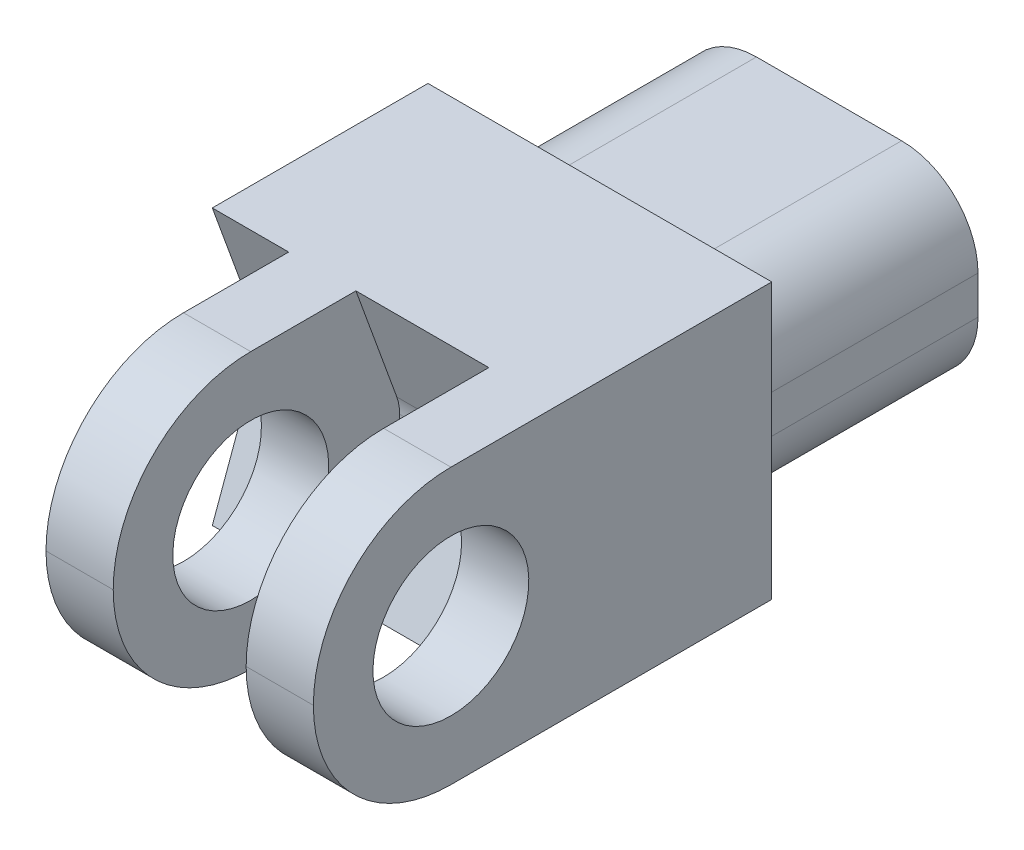
ISO-10303-21;
HEADER;
FILE_DESCRIPTION(('STEP AP214'),'2;1');
FILE_NAME('part.step','',(''),(''),'','','');
FILE_SCHEMA(('AUTOMOTIVE_DESIGN { 1 0 10303 214 1 1 1 1 }'));
ENDSEC;
DATA;
#1=APPLICATION_CONTEXT('core data for automotive mechanical design processes');
#2=APPLICATION_PROTOCOL_DEFINITION('international standard','automotive_design',2000,#1);
#3=PRODUCT_CONTEXT('',#1,'mechanical');
#4=PRODUCT('Part','Part','',(#3));
#5=PRODUCT_RELATED_PRODUCT_CATEGORY('part','',(#4));
#6=PRODUCT_DEFINITION_FORMATION('','',#4);
#7=PRODUCT_DEFINITION_CONTEXT('part definition',#1,'design');
#8=PRODUCT_DEFINITION('design','',#6,#7);
#9=PRODUCT_DEFINITION_SHAPE('','',#8);
#10=(LENGTH_UNIT() NAMED_UNIT(*) SI_UNIT(.MILLI.,.METRE.));
#11=(NAMED_UNIT(*) PLANE_ANGLE_UNIT() SI_UNIT($,.RADIAN.));
#12=(NAMED_UNIT(*) SI_UNIT($,.STERADIAN.) SOLID_ANGLE_UNIT());
#13=UNCERTAINTY_MEASURE_WITH_UNIT(LENGTH_MEASURE(1.E-05),#10,'distance_accuracy_value','');
#14=(GEOMETRIC_REPRESENTATION_CONTEXT(3) GLOBAL_UNCERTAINTY_ASSIGNED_CONTEXT((#13)) GLOBAL_UNIT_ASSIGNED_CONTEXT((#10,
#11,#12)) REPRESENTATION_CONTEXT('',''));
#15=CARTESIAN_POINT('',(0.,0.,0.));
#16=DIRECTION('',(0.,0.,1.));
#17=DIRECTION('',(1.,0.,0.));
#18=AXIS2_PLACEMENT_3D('',#15,#16,#17);
#19=CARTESIAN_POINT('',(-2.3495,11.43,38.1));
#20=DIRECTION('',(-1.,0.,0.));
#21=DIRECTION('',(0.,-1.,0.));
#22=AXIS2_PLACEMENT_3D('',#19,#20,#21);
#23=PLANE('',#22);
#24=CARTESIAN_POINT('',(-2.3495,0.,26.67));
#25=DIRECTION('',(-1.,0.,0.));
#26=DIRECTION('',(0.,-1.,0.));
#27=AXIS2_PLACEMENT_3D('',#24,#25,#26);
#28=CIRCLE('',#27,6.477);
#29=CARTESIAN_POINT('',(-2.3495,-6.477,26.67));
#30=VERTEX_POINT('',#29);
#31=EDGE_CURVE('E299',#30,#30,#28,.T.);
#32=ORIENTED_EDGE('',*,*,#31,.T.);
#33=EDGE_LOOP('',(#32));
#34=FACE_BOUND('',#33,.T.);
#35=DIRECTION('',(0.,-0.93969262078591,0.342020143325663));
#36=VECTOR('',#35,1.);
#37=CARTESIAN_POINT('',(-2.3495,2.27247579142483,12.9399090188302));
#38=LINE('',#37,#36);
#39=CARTESIAN_POINT('',(-2.3495,-2.09277265046882,14.5287295168564));
#40=VERTEX_POINT('',#39);
#41=CARTESIAN_POINT('',(-2.3495,-11.43,17.9272023426619));
#42=VERTEX_POINT('',#41);
#43=EDGE_CURVE('E266',#40,#42,#38,.T.);
#44=ORIENTED_EDGE('',*,*,#43,.F.);
#45=CARTESIAN_POINT('',(-2.3495,-0.724692077166165,18.2875));
#46=DIRECTION('',(-1.,0.,0.));
#47=DIRECTION('',(0.,-1.,0.));
#48=AXIS2_PLACEMENT_3D('',#45,#46,#47);
#49=CIRCLE('',#48,4.);
#50=CARTESIAN_POINT('',(-2.3495,-0.724692077166165,14.2875));
#51=VERTEX_POINT('',#50);
#52=EDGE_CURVE('E497',#40,#51,#49,.F.);
#53=ORIENTED_EDGE('',*,*,#52,.T.);
#54=DIRECTION('',(0.,-1.,0.));
#55=VECTOR('',#54,1.);
#56=CARTESIAN_POINT('',(-2.34950000000001,11.43,14.2875));
#57=LINE('',#56,#55);
#58=CARTESIAN_POINT('',(-2.3495,0.724692077166165,14.2875));
#59=VERTEX_POINT('',#58);
#60=EDGE_CURVE('E326',#59,#51,#57,.T.);
#61=ORIENTED_EDGE('',*,*,#60,.F.);
#62=CARTESIAN_POINT('',(-2.3495,0.724692077166165,18.2875));
#63=DIRECTION('',(-1.,0.,0.));
#64=DIRECTION('',(0.,-1.,0.));
#65=AXIS2_PLACEMENT_3D('',#62,#63,#64);
#66=CIRCLE('',#65,4.);
#67=CARTESIAN_POINT('',(-2.3495,2.09277265046882,14.5287295168564));
#68=VERTEX_POINT('',#67);
#69=EDGE_CURVE('E494',#59,#68,#66,.F.);
#70=ORIENTED_EDGE('',*,*,#69,.T.);
#71=DIRECTION('',(0.,0.93969262078591,0.342020143325663));
#72=VECTOR('',#71,1.);
#73=CARTESIAN_POINT('',(-2.34950000000001,17.9134121934252,20.2869713975472));
#74=LINE('',#73,#72);
#75=CARTESIAN_POINT('',(-2.3495,11.43,17.927202342662));
#76=VERTEX_POINT('',#75);
#77=EDGE_CURVE('E284',#68,#76,#74,.T.);
#78=ORIENTED_EDGE('',*,*,#77,.T.);
#79=DIRECTION('',(0.,0.,-1.));
#80=VECTOR('',#79,1.);
#81=CARTESIAN_POINT('',(-2.3495,11.43,38.1));
#82=LINE('',#81,#80);
#83=CARTESIAN_POINT('',(-2.3495,11.43,26.67));
#84=VERTEX_POINT('',#83);
#85=EDGE_CURVE('E318',#84,#76,#82,.T.);
#86=ORIENTED_EDGE('',*,*,#85,.F.);
#87=CARTESIAN_POINT('',(-2.3495,0.,26.67));
#88=DIRECTION('',(-1.,0.,0.));
#89=DIRECTION('',(0.,-1.,0.));
#90=AXIS2_PLACEMENT_3D('',#87,#88,#89);
#91=CIRCLE('',#90,11.43);
#92=CARTESIAN_POINT('',(-2.3495,0.,38.1));
#93=VERTEX_POINT('',#92);
#94=EDGE_CURVE('E378',#84,#93,#91,.F.);
#95=ORIENTED_EDGE('',*,*,#94,.T.);
#96=CARTESIAN_POINT('',(-2.3495,0.,26.67));
#97=DIRECTION('',(-1.,0.,0.));
#98=DIRECTION('',(0.,-1.,0.));
#99=AXIS2_PLACEMENT_3D('',#96,#97,#98);
#100=CIRCLE('',#99,11.43);
#101=CARTESIAN_POINT('',(-2.3495,-11.43,26.67));
#102=VERTEX_POINT('',#101);
#103=EDGE_CURVE('E395',#93,#102,#100,.F.);
#104=ORIENTED_EDGE('',*,*,#103,.T.);
#105=DIRECTION('',(0.,0.,-1.));
#106=VECTOR('',#105,1.);
#107=CARTESIAN_POINT('',(-2.3495,-11.43,38.1));
#108=LINE('',#107,#106);
#109=EDGE_CURVE('E327',#102,#42,#108,.T.);
#110=ORIENTED_EDGE('',*,*,#109,.T.);
#111=EDGE_LOOP('',(#44,#53,#61,#70,#78,#86,#95,#104,#110));
#112=FACE_BOUND('',#111,.T.);
#113=ADVANCED_FACE('F41',(#34,#112),#23,.F.);
#114=CARTESIAN_POINT('',(8.6995,11.43,38.1));
#115=DIRECTION('',(1.,0.,0.));
#116=DIRECTION('',(0.,1.,0.));
#117=AXIS2_PLACEMENT_3D('',#114,#115,#116);
#118=PLANE('',#117);
#119=CARTESIAN_POINT('',(8.6995,0.,26.67));
#120=DIRECTION('',(1.,0.,0.));
#121=DIRECTION('',(0.,1.,0.));
#122=AXIS2_PLACEMENT_3D('',#119,#120,#121);
#123=CIRCLE('',#122,6.477);
#124=CARTESIAN_POINT('',(8.6995,6.477,26.67));
#125=VERTEX_POINT('',#124);
#126=EDGE_CURVE('E292',#125,#125,#123,.T.);
#127=ORIENTED_EDGE('',*,*,#126,.T.);
#128=EDGE_LOOP('',(#127));
#129=FACE_BOUND('',#128,.T.);
#130=DIRECTION('',(0.,-1.,0.));
#131=VECTOR('',#130,1.);
#132=CARTESIAN_POINT('',(8.6995,11.43,14.2875));
#133=LINE('',#132,#131);
#134=CARTESIAN_POINT('',(8.6995,0.72469207716617,14.2875));
#135=VERTEX_POINT('',#134);
#136=CARTESIAN_POINT('',(8.6995,-0.72469207716617,14.2875));
#137=VERTEX_POINT('',#136);
#138=EDGE_CURVE('E310',#135,#137,#133,.T.);
#139=ORIENTED_EDGE('',*,*,#138,.T.);
#140=CARTESIAN_POINT('',(8.6995,-0.72469207716617,18.2875));
#141=DIRECTION('',(1.,0.,0.));
#142=DIRECTION('',(0.,1.,0.));
#143=AXIS2_PLACEMENT_3D('',#140,#141,#142);
#144=CIRCLE('',#143,4.);
#145=CARTESIAN_POINT('',(8.6995,-2.09277265046882,14.5287295168564));
#146=VERTEX_POINT('',#145);
#147=EDGE_CURVE('E510',#137,#146,#144,.F.);
#148=ORIENTED_EDGE('',*,*,#147,.T.);
#149=DIRECTION('',(0.,0.93969262078591,-0.342020143325663));
#150=VECTOR('',#149,1.);
#151=CARTESIAN_POINT('',(8.6995,2.27247579142483,12.9399090188302));
#152=LINE('',#151,#150);
#153=CARTESIAN_POINT('',(8.6995,-11.43,17.9272023426619));
#154=VERTEX_POINT('',#153);
#155=EDGE_CURVE('E262',#154,#146,#152,.T.);
#156=ORIENTED_EDGE('',*,*,#155,.F.);
#157=DIRECTION('',(0.,0.,1.));
#158=VECTOR('',#157,1.);
#159=CARTESIAN_POINT('',(8.6995,-11.43,38.1));
#160=LINE('',#159,#158);
#161=CARTESIAN_POINT('',(8.6995,-11.43,26.67));
#162=VERTEX_POINT('',#161);
#163=EDGE_CURVE('E323',#154,#162,#160,.T.);
#164=ORIENTED_EDGE('',*,*,#163,.T.);
#165=CARTESIAN_POINT('',(8.6995,0.,26.67));
#166=DIRECTION('',(1.,0.,0.));
#167=DIRECTION('',(0.,1.,0.));
#168=AXIS2_PLACEMENT_3D('',#165,#166,#167);
#169=CIRCLE('',#168,11.43);
#170=CARTESIAN_POINT('',(8.6995,0.,38.1));
#171=VERTEX_POINT('',#170);
#172=EDGE_CURVE('E419',#162,#171,#169,.F.);
#173=ORIENTED_EDGE('',*,*,#172,.T.);
#174=CARTESIAN_POINT('',(8.6995,0.,26.67));
#175=DIRECTION('',(1.,0.,0.));
#176=DIRECTION('',(0.,1.,0.));
#177=AXIS2_PLACEMENT_3D('',#174,#175,#176);
#178=CIRCLE('',#177,11.43);
#179=CARTESIAN_POINT('',(8.6995,11.43,26.67));
#180=VERTEX_POINT('',#179);
#181=EDGE_CURVE('E422',#171,#180,#178,.F.);
#182=ORIENTED_EDGE('',*,*,#181,.T.);
#183=DIRECTION('',(0.,0.,1.));
#184=VECTOR('',#183,1.);
#185=CARTESIAN_POINT('',(8.6995,11.43,38.1));
#186=LINE('',#185,#184);
#187=CARTESIAN_POINT('',(8.6995,11.43,17.927202342662));
#188=VERTEX_POINT('',#187);
#189=EDGE_CURVE('E322',#188,#180,#186,.T.);
#190=ORIENTED_EDGE('',*,*,#189,.F.);
#191=DIRECTION('',(0.,-0.93969262078591,-0.342020143325663));
#192=VECTOR('',#191,1.);
#193=CARTESIAN_POINT('',(8.6995,17.9134121934252,20.2869713975472));
#194=LINE('',#193,#192);
#195=CARTESIAN_POINT('',(8.6995,2.09277265046882,14.5287295168564));
#196=VERTEX_POINT('',#195);
#197=EDGE_CURVE('E280',#188,#196,#194,.T.);
#198=ORIENTED_EDGE('',*,*,#197,.T.);
#199=CARTESIAN_POINT('',(8.6995,0.72469207716617,18.2875));
#200=DIRECTION('',(1.,0.,0.));
#201=DIRECTION('',(0.,1.,0.));
#202=AXIS2_PLACEMENT_3D('',#199,#200,#201);
#203=CIRCLE('',#202,4.);
#204=EDGE_CURVE('E507',#196,#135,#203,.F.);
#205=ORIENTED_EDGE('',*,*,#204,.T.);
#206=EDGE_LOOP('',(#139,#148,#156,#164,#173,#182,#190,#198,#205));
#207=FACE_BOUND('',#206,.T.);
#208=ADVANCED_FACE('F551',(#129,#207),#118,.F.);
#209=CARTESIAN_POINT('',(-2.34950000000001,11.43,14.2875));
#210=DIRECTION('',(0.,0.,-1.));
#211=DIRECTION('',(-1.,0.,0.));
#212=AXIS2_PLACEMENT_3D('',#209,#210,#211);
#213=PLANE('',#212);
#214=ORIENTED_EDGE('',*,*,#60,.T.);
#215=DIRECTION('',(-1.,0.,0.));
#216=VECTOR('',#215,1.);
#217=CARTESIAN_POINT('',(8.69950000000001,-0.72469207716617,14.2875));
#218=LINE('',#217,#216);
#219=EDGE_CURVE('E504',#51,#137,#218,.F.);
#220=ORIENTED_EDGE('',*,*,#219,.T.);
#221=ORIENTED_EDGE('',*,*,#138,.F.);
#222=DIRECTION('',(-1.,0.,0.));
#223=VECTOR('',#222,1.);
#224=CARTESIAN_POINT('',(-2.3495,0.724692077166165,14.2875));
#225=LINE('',#224,#223);
#226=EDGE_CURVE('E500',#135,#59,#225,.T.);
#227=ORIENTED_EDGE('',*,*,#226,.T.);
#228=EDGE_LOOP('',(#214,#220,#221,#227));
#229=FACE_BOUND('',#228,.T.);
#230=ADVANCED_FACE('F558',(#229),#213,.F.);
#231=CARTESIAN_POINT('',(-7.9375,11.43,38.1));
#232=DIRECTION('',(1.,0.,0.));
#233=DIRECTION('',(0.,1.,0.));
#234=AXIS2_PLACEMENT_3D('',#231,#232,#233);
#235=PLANE('',#234);
#236=CARTESIAN_POINT('',(-7.9375,0.,26.67));
#237=DIRECTION('',(-1.,0.,0.));
#238=DIRECTION('',(0.,-1.,0.));
#239=AXIS2_PLACEMENT_3D('',#236,#237,#238);
#240=CIRCLE('',#239,6.477);
#241=CARTESIAN_POINT('',(-7.9375,-6.477,26.67));
#242=VERTEX_POINT('',#241);
#243=EDGE_CURVE('E287',#242,#242,#240,.T.);
#244=ORIENTED_EDGE('',*,*,#243,.F.);
#245=EDGE_LOOP('',(#244));
#246=FACE_BOUND('',#245,.T.);
#247=DIRECTION('',(0.,-1.,0.));
#248=VECTOR('',#247,1.);
#249=CARTESIAN_POINT('',(-7.9375,11.43,14.2875));
#250=LINE('',#249,#248);
#251=CARTESIAN_POINT('',(-7.9375,0.724692077166156,14.2875));
#252=VERTEX_POINT('',#251);
#253=CARTESIAN_POINT('',(-7.9375,-0.724692077166153,14.2875));
#254=VERTEX_POINT('',#253);
#255=EDGE_CURVE('E311',#252,#254,#250,.T.);
#256=ORIENTED_EDGE('',*,*,#255,.T.);
#257=CARTESIAN_POINT('',(-7.9375,-0.724692077166153,18.2875));
#258=DIRECTION('',(1.,0.,0.));
#259=DIRECTION('',(0.,1.,0.));
#260=AXIS2_PLACEMENT_3D('',#257,#258,#259);
#261=CIRCLE('',#260,4.);
#262=CARTESIAN_POINT('',(-7.9375,-2.09277265046881,14.5287295168564));
#263=VERTEX_POINT('',#262);
#264=EDGE_CURVE('E528',#254,#263,#261,.F.);
#265=ORIENTED_EDGE('',*,*,#264,.T.);
#266=DIRECTION('',(0.,0.93969262078591,-0.342020143325663));
#267=VECTOR('',#266,1.);
#268=CARTESIAN_POINT('',(-7.9375,2.27247579142483,12.9399090188302));
#269=LINE('',#268,#267);
#270=CARTESIAN_POINT('',(-7.9375,-11.43,17.9272023426619));
#271=VERTEX_POINT('',#270);
#272=EDGE_CURVE('E258',#271,#263,#269,.T.);
#273=ORIENTED_EDGE('',*,*,#272,.F.);
#274=DIRECTION('',(0.,0.,1.));
#275=VECTOR('',#274,1.);
#276=CARTESIAN_POINT('',(-7.9375,-11.43,38.1));
#277=LINE('',#276,#275);
#278=CARTESIAN_POINT('',(-7.9375,-11.43,26.67));
#279=VERTEX_POINT('',#278);
#280=EDGE_CURVE('E252',#271,#279,#277,.T.);
#281=ORIENTED_EDGE('',*,*,#280,.T.);
#282=CARTESIAN_POINT('',(-7.9375,0.,26.67));
#283=DIRECTION('',(1.,0.,0.));
#284=DIRECTION('',(0.,1.,0.));
#285=AXIS2_PLACEMENT_3D('',#282,#283,#284);
#286=CIRCLE('',#285,11.43);
#287=CARTESIAN_POINT('',(-7.9375,0.,38.1));
#288=VERTEX_POINT('',#287);
#289=EDGE_CURVE('E409',#279,#288,#286,.F.);
#290=ORIENTED_EDGE('',*,*,#289,.T.);
#291=CARTESIAN_POINT('',(-7.9375,0.,26.67));
#292=DIRECTION('',(1.,0.,0.));
#293=DIRECTION('',(0.,1.,0.));
#294=AXIS2_PLACEMENT_3D('',#291,#292,#293);
#295=CIRCLE('',#294,11.43);
#296=CARTESIAN_POINT('',(-7.9375,11.43,26.67));
#297=VERTEX_POINT('',#296);
#298=EDGE_CURVE('E405',#288,#297,#295,.F.);
#299=ORIENTED_EDGE('',*,*,#298,.T.);
#300=DIRECTION('',(0.,0.,1.));
#301=VECTOR('',#300,1.);
#302=CARTESIAN_POINT('',(-7.9375,11.43,38.1));
#303=LINE('',#302,#301);
#304=CARTESIAN_POINT('',(-7.9375,11.43,17.927202342662));
#305=VERTEX_POINT('',#304);
#306=EDGE_CURVE('E304',#305,#297,#303,.T.);
#307=ORIENTED_EDGE('',*,*,#306,.F.);
#308=DIRECTION('',(0.,-0.93969262078591,-0.342020143325663));
#309=VECTOR('',#308,1.);
#310=CARTESIAN_POINT('',(-7.93750000000001,17.9134121934252,20.2869713975472));
#311=LINE('',#310,#309);
#312=CARTESIAN_POINT('',(-7.9375,2.09277265046881,14.5287295168564));
#313=VERTEX_POINT('',#312);
#314=EDGE_CURVE('E277',#305,#313,#311,.T.);
#315=ORIENTED_EDGE('',*,*,#314,.T.);
#316=CARTESIAN_POINT('',(-7.9375,0.724692077166155,18.2875));
#317=DIRECTION('',(1.,0.,0.));
#318=DIRECTION('',(0.,1.,0.));
#319=AXIS2_PLACEMENT_3D('',#316,#317,#318);
#320=CIRCLE('',#319,4.);
#321=EDGE_CURVE('E525',#313,#252,#320,.F.);
#322=ORIENTED_EDGE('',*,*,#321,.T.);
#323=EDGE_LOOP('',(#256,#265,#273,#281,#290,#299,#307,#315,#322));
#324=FACE_BOUND('',#323,.T.);
#325=ADVANCED_FACE('F542',(#246,#324),#235,.F.);
#326=CARTESIAN_POINT('',(-14.2875,11.43,14.2875));
#327=DIRECTION('',(0.,0.,-1.));
#328=DIRECTION('',(-1.,0.,0.));
#329=AXIS2_PLACEMENT_3D('',#326,#327,#328);
#330=PLANE('',#329);
#331=DIRECTION('',(0.,-1.,0.));
#332=VECTOR('',#331,1.);
#333=CARTESIAN_POINT('',(-14.2875,11.43,14.2875));
#334=LINE('',#333,#332);
#335=CARTESIAN_POINT('',(-14.2875,0.724692077166165,14.2875));
#336=VERTEX_POINT('',#335);
#337=CARTESIAN_POINT('',(-14.2875,-0.724692077166163,14.2875));
#338=VERTEX_POINT('',#337);
#339=EDGE_CURVE('E307',#336,#338,#334,.T.);
#340=ORIENTED_EDGE('',*,*,#339,.T.);
#341=DIRECTION('',(-1.,0.,0.));
#342=VECTOR('',#341,1.);
#343=CARTESIAN_POINT('',(-7.93749999999999,-0.724692077166153,14.2875));
#344=LINE('',#343,#342);
#345=EDGE_CURVE('E522',#338,#254,#344,.F.);
#346=ORIENTED_EDGE('',*,*,#345,.T.);
#347=ORIENTED_EDGE('',*,*,#255,.F.);
#348=DIRECTION('',(-1.,0.,0.));
#349=VECTOR('',#348,1.);
#350=CARTESIAN_POINT('',(-14.2875,0.724692077166165,14.2875));
#351=LINE('',#350,#349);
#352=EDGE_CURVE('E518',#252,#336,#351,.T.);
#353=ORIENTED_EDGE('',*,*,#352,.T.);
#354=EDGE_LOOP('',(#340,#346,#347,#353));
#355=FACE_BOUND('',#354,.T.);
#356=ADVANCED_FACE('F536',(#355),#330,.F.);
#357=CARTESIAN_POINT('',(-12.3825,-7.9375,-19.05));
#358=DIRECTION('',(-1.,0.,0.));
#359=DIRECTION('',(0.,0.,1.));
#360=AXIS2_PLACEMENT_3D('',#357,#358,#359);
#361=PLANE('',#360);
#362=DIRECTION('',(0.,-1.,0.));
#363=VECTOR('',#362,1.);
#364=CARTESIAN_POINT('',(-12.3825,-7.9375,-19.05));
#365=LINE('',#364,#363);
#366=CARTESIAN_POINT('',(-12.3825,1.5875,-19.05));
#367=VERTEX_POINT('',#366);
#368=CARTESIAN_POINT('',(-12.3825,-1.5875,-19.05));
#369=VERTEX_POINT('',#368);
#370=EDGE_CURVE('E361',#367,#369,#365,.T.);
#371=ORIENTED_EDGE('',*,*,#370,.T.);
#372=DIRECTION('',(0.,0.,1.));
#373=VECTOR('',#372,1.);
#374=CARTESIAN_POINT('',(-12.3825,-1.5875,-19.05));
#375=LINE('',#374,#373);
#376=CARTESIAN_POINT('',(-12.3825,-1.5875,0.));
#377=VERTEX_POINT('',#376);
#378=EDGE_CURVE('E441',#369,#377,#375,.T.);
#379=ORIENTED_EDGE('',*,*,#378,.T.);
#380=DIRECTION('',(0.,-1.,0.));
#381=VECTOR('',#380,1.);
#382=CARTESIAN_POINT('',(-12.3825,-7.9375,0.));
#383=LINE('',#382,#381);
#384=CARTESIAN_POINT('',(-12.3825,1.5875,0.));
#385=VERTEX_POINT('',#384);
#386=EDGE_CURVE('E246',#385,#377,#383,.T.);
#387=ORIENTED_EDGE('',*,*,#386,.F.);
#388=DIRECTION('',(0.,0.,1.));
#389=VECTOR('',#388,1.);
#390=CARTESIAN_POINT('',(-12.3825,1.5875,-19.05));
#391=LINE('',#390,#389);
#392=EDGE_CURVE('E432',#385,#367,#391,.F.);
#393=ORIENTED_EDGE('',*,*,#392,.T.);
#394=EDGE_LOOP('',(#371,#379,#387,#393));
#395=FACE_BOUND('',#394,.T.);
#396=ADVANCED_FACE('F589',(#395),#361,.T.);
#397=CARTESIAN_POINT('',(12.3825,7.9375,-19.05));
#398=DIRECTION('',(0.,1.,0.));
#399=DIRECTION('',(-1.,0.,0.));
#400=AXIS2_PLACEMENT_3D('',#397,#398,#399);
#401=PLANE('',#400);
#402=DIRECTION('',(-1.,0.,0.));
#403=VECTOR('',#402,1.);
#404=CARTESIAN_POINT('',(12.3825,7.9375,-19.05));
#405=LINE('',#404,#403);
#406=CARTESIAN_POINT('',(6.03250000000001,7.9375,-19.05));
#407=VERTEX_POINT('',#406);
#408=CARTESIAN_POINT('',(-6.03249999999999,7.9375,-19.05));
#409=VERTEX_POINT('',#408);
#410=EDGE_CURVE('E374',#407,#409,#405,.T.);
#411=ORIENTED_EDGE('',*,*,#410,.T.);
#412=DIRECTION('',(0.,0.,1.));
#413=VECTOR('',#412,1.);
#414=CARTESIAN_POINT('',(-6.03249999999999,7.9375,-19.05));
#415=LINE('',#414,#413);
#416=CARTESIAN_POINT('',(-6.03249999999999,7.9375,0.));
#417=VERTEX_POINT('',#416);
#418=EDGE_CURVE('E467',#409,#417,#415,.T.);
#419=ORIENTED_EDGE('',*,*,#418,.T.);
#420=DIRECTION('',(-1.,0.,0.));
#421=VECTOR('',#420,1.);
#422=CARTESIAN_POINT('',(12.3825,7.9375,0.));
#423=LINE('',#422,#421);
#424=CARTESIAN_POINT('',(6.03250000000001,7.9375,0.));
#425=VERTEX_POINT('',#424);
#426=EDGE_CURVE('E366',#425,#417,#423,.T.);
#427=ORIENTED_EDGE('',*,*,#426,.F.);
#428=DIRECTION('',(0.,0.,1.));
#429=VECTOR('',#428,1.);
#430=CARTESIAN_POINT('',(6.03250000000001,7.9375,-19.05));
#431=LINE('',#430,#429);
#432=EDGE_CURVE('E464',#425,#407,#431,.F.);
#433=ORIENTED_EDGE('',*,*,#432,.T.);
#434=EDGE_LOOP('',(#411,#419,#427,#433));
#435=FACE_BOUND('',#434,.T.);
#436=ADVANCED_FACE('F585',(#435),#401,.T.);
#437=CARTESIAN_POINT('',(12.3825,-7.9375,-19.05));
#438=DIRECTION('',(1.,0.,0.));
#439=DIRECTION('',(0.,0.,-1.));
#440=AXIS2_PLACEMENT_3D('',#437,#438,#439);
#441=PLANE('',#440);
#442=DIRECTION('',(0.,1.,0.));
#443=VECTOR('',#442,1.);
#444=CARTESIAN_POINT('',(12.3825,-7.9375,0.));
#445=LINE('',#444,#443);
#446=CARTESIAN_POINT('',(12.3825,-1.5875,0.));
#447=VERTEX_POINT('',#446);
#448=CARTESIAN_POINT('',(12.3825,1.5875,0.));
#449=VERTEX_POINT('',#448);
#450=EDGE_CURVE('E386',#447,#449,#445,.T.);
#451=ORIENTED_EDGE('',*,*,#450,.F.);
#452=DIRECTION('',(0.,0.,1.));
#453=VECTOR('',#452,1.);
#454=CARTESIAN_POINT('',(12.3825,-1.5875,-19.05));
#455=LINE('',#454,#453);
#456=CARTESIAN_POINT('',(12.3825,-1.5875,-19.05));
#457=VERTEX_POINT('',#456);
#458=EDGE_CURVE('E475',#447,#457,#455,.F.);
#459=ORIENTED_EDGE('',*,*,#458,.T.);
#460=DIRECTION('',(0.,1.,0.));
#461=VECTOR('',#460,1.);
#462=CARTESIAN_POINT('',(12.3825,-7.9375,-19.05));
#463=LINE('',#462,#461);
#464=CARTESIAN_POINT('',(12.3825,1.5875,-19.05));
#465=VERTEX_POINT('',#464);
#466=EDGE_CURVE('E370',#457,#465,#463,.T.);
#467=ORIENTED_EDGE('',*,*,#466,.T.);
#468=DIRECTION('',(0.,0.,1.));
#469=VECTOR('',#468,1.);
#470=CARTESIAN_POINT('',(12.3825,1.5875,-19.05));
#471=LINE('',#470,#469);
#472=EDGE_CURVE('E471',#465,#449,#471,.T.);
#473=ORIENTED_EDGE('',*,*,#472,.T.);
#474=EDGE_LOOP('',(#451,#459,#467,#473));
#475=FACE_BOUND('',#474,.T.);
#476=ADVANCED_FACE('F588',(#475),#441,.T.);
#477=CARTESIAN_POINT('',(12.3825,-7.9375,-19.05));
#478=DIRECTION('',(0.,-1.,0.));
#479=DIRECTION('',(1.,0.,0.));
#480=AXIS2_PLACEMENT_3D('',#477,#478,#479);
#481=PLANE('',#480);
#482=DIRECTION('',(1.,0.,0.));
#483=VECTOR('',#482,1.);
#484=CARTESIAN_POINT('',(12.3825,-7.9375,0.));
#485=LINE('',#484,#483);
#486=CARTESIAN_POINT('',(-6.0325,-7.9375,0.));
#487=VERTEX_POINT('',#486);
#488=CARTESIAN_POINT('',(6.03250000000001,-7.9375,0.));
#489=VERTEX_POINT('',#488);
#490=EDGE_CURVE('E382',#487,#489,#485,.T.);
#491=ORIENTED_EDGE('',*,*,#490,.F.);
#492=DIRECTION('',(0.,0.,1.));
#493=VECTOR('',#492,1.);
#494=CARTESIAN_POINT('',(-6.0325,-7.9375,-19.05));
#495=LINE('',#494,#493);
#496=CARTESIAN_POINT('',(-6.0325,-7.9375,-19.05));
#497=VERTEX_POINT('',#496);
#498=EDGE_CURVE('E449',#487,#497,#495,.F.);
#499=ORIENTED_EDGE('',*,*,#498,.T.);
#500=DIRECTION('',(1.,0.,0.));
#501=VECTOR('',#500,1.);
#502=CARTESIAN_POINT('',(12.3825,-7.9375,-19.05));
#503=LINE('',#502,#501);
#504=CARTESIAN_POINT('',(6.03250000000001,-7.9375,-19.05));
#505=VERTEX_POINT('',#504);
#506=EDGE_CURVE('E365',#497,#505,#503,.T.);
#507=ORIENTED_EDGE('',*,*,#506,.T.);
#508=DIRECTION('',(0.,0.,1.));
#509=VECTOR('',#508,1.);
#510=CARTESIAN_POINT('',(6.03250000000001,-7.9375,-19.05));
#511=LINE('',#510,#509);
#512=EDGE_CURVE('E445',#505,#489,#511,.T.);
#513=ORIENTED_EDGE('',*,*,#512,.T.);
#514=EDGE_LOOP('',(#491,#499,#507,#513));
#515=FACE_BOUND('',#514,.T.);
#516=ADVANCED_FACE('F583',(#515),#481,.T.);
#517=CARTESIAN_POINT('',(0.,0.,-19.05));
#518=DIRECTION('',(0.,0.,1.));
#519=DIRECTION('',(1.,0.,0.));
#520=AXIS2_PLACEMENT_3D('',#517,#518,#519);
#521=PLANE('',#520);
#522=ORIENTED_EDGE('',*,*,#506,.F.);
#523=CARTESIAN_POINT('',(-6.0325,-1.5875,-19.05));
#524=DIRECTION('',(0.,0.,1.));
#525=DIRECTION('',(1.,0.,0.));
#526=AXIS2_PLACEMENT_3D('',#523,#524,#525);
#527=CIRCLE('',#526,6.35);
#528=EDGE_CURVE('E461',#497,#369,#527,.F.);
#529=ORIENTED_EDGE('',*,*,#528,.T.);
#530=ORIENTED_EDGE('',*,*,#370,.F.);
#531=CARTESIAN_POINT('',(-6.03249999999999,1.5875,-19.05));
#532=DIRECTION('',(0.,0.,1.));
#533=DIRECTION('',(1.,0.,0.));
#534=AXIS2_PLACEMENT_3D('',#531,#532,#533);
#535=CIRCLE('',#534,6.35);
#536=EDGE_CURVE('E458',#367,#409,#535,.F.);
#537=ORIENTED_EDGE('',*,*,#536,.T.);
#538=ORIENTED_EDGE('',*,*,#410,.F.);
#539=CARTESIAN_POINT('',(6.03250000000001,1.5875,-19.05));
#540=DIRECTION('',(0.,0.,1.));
#541=DIRECTION('',(1.,0.,0.));
#542=AXIS2_PLACEMENT_3D('',#539,#540,#541);
#543=CIRCLE('',#542,6.35);
#544=EDGE_CURVE('E452',#407,#465,#543,.F.);
#545=ORIENTED_EDGE('',*,*,#544,.T.);
#546=ORIENTED_EDGE('',*,*,#466,.F.);
#547=CARTESIAN_POINT('',(6.03250000000001,-1.5875,-19.05));
#548=DIRECTION('',(0.,0.,1.));
#549=DIRECTION('',(1.,0.,0.));
#550=AXIS2_PLACEMENT_3D('',#547,#548,#549);
#551=CIRCLE('',#550,6.35);
#552=EDGE_CURVE('E455',#457,#505,#551,.F.);
#553=ORIENTED_EDGE('',*,*,#552,.T.);
#554=EDGE_LOOP('',(#522,#529,#530,#537,#538,#545,#546,#553));
#555=FACE_BOUND('',#554,.T.);
#556=ADVANCED_FACE('F567',(#555),#521,.F.);
#557=CARTESIAN_POINT('',(0.,0.,0.));
#558=DIRECTION('',(0.,0.,1.));
#559=DIRECTION('',(1.,0.,0.));
#560=AXIS2_PLACEMENT_3D('',#557,#558,#559);
#561=PLANE('',#560);
#562=DIRECTION('',(0.,-1.,0.));
#563=VECTOR('',#562,1.);
#564=CARTESIAN_POINT('',(-14.2875,-11.43,0.));
#565=LINE('',#564,#563);
#566=CARTESIAN_POINT('',(-14.2875,11.43,0.));
#567=VERTEX_POINT('',#566);
#568=CARTESIAN_POINT('',(-14.2875,-11.43,0.));
#569=VERTEX_POINT('',#568);
#570=EDGE_CURVE('E241',#567,#569,#565,.T.);
#571=ORIENTED_EDGE('',*,*,#570,.F.);
#572=DIRECTION('',(-1.,0.,0.));
#573=VECTOR('',#572,1.);
#574=CARTESIAN_POINT('',(14.2875,11.43,0.));
#575=LINE('',#574,#573);
#576=CARTESIAN_POINT('',(14.2875,11.43,0.));
#577=VERTEX_POINT('',#576);
#578=EDGE_CURVE('E349',#577,#567,#575,.T.);
#579=ORIENTED_EDGE('',*,*,#578,.F.);
#580=DIRECTION('',(0.,1.,0.));
#581=VECTOR('',#580,1.);
#582=CARTESIAN_POINT('',(14.2875,-11.43,0.));
#583=LINE('',#582,#581);
#584=CARTESIAN_POINT('',(14.2875,-11.43,0.));
#585=VERTEX_POINT('',#584);
#586=EDGE_CURVE('E345',#585,#577,#583,.T.);
#587=ORIENTED_EDGE('',*,*,#586,.F.);
#588=DIRECTION('',(1.,0.,0.));
#589=VECTOR('',#588,1.);
#590=CARTESIAN_POINT('',(14.2875,-11.43,0.));
#591=LINE('',#590,#589);
#592=EDGE_CURVE('E342',#569,#585,#591,.T.);
#593=ORIENTED_EDGE('',*,*,#592,.F.);
#594=EDGE_LOOP('',(#571,#579,#587,#593));
#595=FACE_BOUND('',#594,.T.);
#596=ORIENTED_EDGE('',*,*,#450,.T.);
#597=CARTESIAN_POINT('',(6.03250000000001,1.5875,0.));
#598=DIRECTION('',(0.,0.,1.));
#599=DIRECTION('',(1.,0.,0.));
#600=AXIS2_PLACEMENT_3D('',#597,#598,#599);
#601=CIRCLE('',#600,6.35);
#602=EDGE_CURVE('E487',#449,#425,#601,.T.);
#603=ORIENTED_EDGE('',*,*,#602,.T.);
#604=ORIENTED_EDGE('',*,*,#426,.T.);
#605=CARTESIAN_POINT('',(-6.03249999999999,1.5875,0.));
#606=DIRECTION('',(0.,0.,1.));
#607=DIRECTION('',(1.,0.,0.));
#608=AXIS2_PLACEMENT_3D('',#605,#606,#607);
#609=CIRCLE('',#608,6.35);
#610=EDGE_CURVE('E481',#417,#385,#609,.T.);
#611=ORIENTED_EDGE('',*,*,#610,.T.);
#612=ORIENTED_EDGE('',*,*,#386,.T.);
#613=CARTESIAN_POINT('',(-6.0325,-1.5875,0.));
#614=DIRECTION('',(0.,0.,1.));
#615=DIRECTION('',(1.,0.,0.));
#616=AXIS2_PLACEMENT_3D('',#613,#614,#615);
#617=CIRCLE('',#616,6.35);
#618=EDGE_CURVE('E478',#377,#487,#617,.T.);
#619=ORIENTED_EDGE('',*,*,#618,.T.);
#620=ORIENTED_EDGE('',*,*,#490,.T.);
#621=CARTESIAN_POINT('',(6.03250000000001,-1.5875,0.));
#622=DIRECTION('',(0.,0.,1.));
#623=DIRECTION('',(1.,0.,0.));
#624=AXIS2_PLACEMENT_3D('',#621,#622,#623);
#625=CIRCLE('',#624,6.35);
#626=EDGE_CURVE('E484',#489,#447,#625,.T.);
#627=ORIENTED_EDGE('',*,*,#626,.T.);
#628=EDGE_LOOP('',(#596,#603,#604,#611,#612,#619,#620,#627));
#629=FACE_BOUND('',#628,.T.);
#630=ADVANCED_FACE('F564',(#595,#629),#561,.F.);
#631=CARTESIAN_POINT('',(-14.2875,-11.43,38.1));
#632=DIRECTION('',(1.,0.,0.));
#633=DIRECTION('',(0.,0.,-1.));
#634=AXIS2_PLACEMENT_3D('',#631,#632,#633);
#635=PLANE('',#634);
#636=DIRECTION('',(0.,0.,-1.));
#637=VECTOR('',#636,1.);
#638=CARTESIAN_POINT('',(-14.2875,-11.43,38.1));
#639=LINE('',#638,#637);
#640=CARTESIAN_POINT('',(-14.2875,-11.43,17.927202342662));
#641=VERTEX_POINT('',#640);
#642=EDGE_CURVE('E238',#641,#569,#639,.T.);
#643=ORIENTED_EDGE('',*,*,#642,.F.);
#644=DIRECTION('',(0.,-0.93969262078591,0.342020143325663));
#645=VECTOR('',#644,1.);
#646=CARTESIAN_POINT('',(-14.2875,-11.43,17.927202342662));
#647=LINE('',#646,#645);
#648=CARTESIAN_POINT('',(-14.2875,-2.09277265046881,14.5287295168564));
#649=VERTEX_POINT('',#648);
#650=EDGE_CURVE('E227',#649,#641,#647,.T.);
#651=ORIENTED_EDGE('',*,*,#650,.F.);
#652=CARTESIAN_POINT('',(-14.2875,-0.724692077166163,18.2875));
#653=DIRECTION('',(1.,0.,0.));
#654=DIRECTION('',(0.,0.,-1.));
#655=AXIS2_PLACEMENT_3D('',#652,#653,#654);
#656=CIRCLE('',#655,4.);
#657=EDGE_CURVE('E50',#649,#338,#656,.T.);
#658=ORIENTED_EDGE('',*,*,#657,.T.);
#659=ORIENTED_EDGE('',*,*,#339,.F.);
#660=CARTESIAN_POINT('',(-14.2875,0.724692077166165,18.2875));
#661=DIRECTION('',(1.,0.,0.));
#662=DIRECTION('',(0.,0.,-1.));
#663=AXIS2_PLACEMENT_3D('',#660,#661,#662);
#664=CIRCLE('',#663,4.);
#665=CARTESIAN_POINT('',(-14.2875,2.09277265046882,14.5287295168564));
#666=VERTEX_POINT('',#665);
#667=EDGE_CURVE('E11',#336,#666,#664,.T.);
#668=ORIENTED_EDGE('',*,*,#667,.T.);
#669=DIRECTION('',(0.,0.93969262078591,0.342020143325663));
#670=VECTOR('',#669,1.);
#671=CARTESIAN_POINT('',(-14.2875,11.43,17.927202342662));
#672=LINE('',#671,#670);
#673=CARTESIAN_POINT('',(-14.2875,11.43,17.927202342662));
#674=VERTEX_POINT('',#673);
#675=EDGE_CURVE('E269',#666,#674,#672,.T.);
#676=ORIENTED_EDGE('',*,*,#675,.T.);
#677=DIRECTION('',(0.,0.,-1.));
#678=VECTOR('',#677,1.);
#679=CARTESIAN_POINT('',(-14.2875,11.43,38.1));
#680=LINE('',#679,#678);
#681=EDGE_CURVE('E353',#674,#567,#680,.T.);
#682=ORIENTED_EDGE('',*,*,#681,.T.);
#683=ORIENTED_EDGE('',*,*,#570,.T.);
#684=EDGE_LOOP('',(#643,#651,#658,#659,#668,#676,#682,#683));
#685=FACE_BOUND('',#684,.T.);
#686=ADVANCED_FACE('F239',(#685),#635,.F.);
#687=CARTESIAN_POINT('',(14.2875,-11.43,38.1));
#688=DIRECTION('',(0.,1.,0.));
#689=DIRECTION('',(-1.,0.,0.));
#690=AXIS2_PLACEMENT_3D('',#687,#688,#689);
#691=PLANE('',#690);
#692=ORIENTED_EDGE('',*,*,#592,.T.);
#693=DIRECTION('',(0.,0.,-1.));
#694=VECTOR('',#693,1.);
#695=CARTESIAN_POINT('',(14.2875,-11.43,38.1));
#696=LINE('',#695,#694);
#697=CARTESIAN_POINT('',(14.2875,-11.43,26.67));
#698=VERTEX_POINT('',#697);
#699=EDGE_CURVE('E247',#698,#585,#696,.T.);
#700=ORIENTED_EDGE('',*,*,#699,.F.);
#701=DIRECTION('',(1.,0.,0.));
#702=VECTOR('',#701,1.);
#703=CARTESIAN_POINT('',(8.6995,-11.43,26.67));
#704=LINE('',#703,#702);
#705=EDGE_CURVE('E398',#698,#162,#704,.F.);
#706=ORIENTED_EDGE('',*,*,#705,.T.);
#707=ORIENTED_EDGE('',*,*,#163,.F.);
#708=DIRECTION('',(-1.,0.,0.));
#709=VECTOR('',#708,1.);
#710=CARTESIAN_POINT('',(24.9292777247591,-11.43,17.927202342662));
#711=LINE('',#710,#709);
#712=EDGE_CURVE('E254',#154,#42,#711,.T.);
#713=ORIENTED_EDGE('',*,*,#712,.T.);
#714=ORIENTED_EDGE('',*,*,#109,.F.);
#715=DIRECTION('',(1.,0.,0.));
#716=VECTOR('',#715,1.);
#717=CARTESIAN_POINT('',(-7.9375,-11.43,26.67));
#718=LINE('',#717,#716);
#719=EDGE_CURVE('E402',#102,#279,#718,.F.);
#720=ORIENTED_EDGE('',*,*,#719,.T.);
#721=ORIENTED_EDGE('',*,*,#280,.F.);
#722=EDGE_CURVE('E232',#271,#641,#711,.T.);
#723=ORIENTED_EDGE('',*,*,#722,.T.);
#724=ORIENTED_EDGE('',*,*,#642,.T.);
#725=EDGE_LOOP('',(#692,#700,#706,#707,#713,#714,#720,#721,#723,#724));
#726=FACE_BOUND('',#725,.T.);
#727=ADVANCED_FACE('F250',(#726),#691,.F.);
#728=CARTESIAN_POINT('',(14.2875,-11.43,38.1));
#729=DIRECTION('',(-1.,0.,0.));
#730=DIRECTION('',(0.,0.,1.));
#731=AXIS2_PLACEMENT_3D('',#728,#729,#730);
#732=PLANE('',#731);
#733=ORIENTED_EDGE('',*,*,#699,.T.);
#734=ORIENTED_EDGE('',*,*,#586,.T.);
#735=DIRECTION('',(0.,0.,-1.));
#736=VECTOR('',#735,1.);
#737=CARTESIAN_POINT('',(14.2875,11.43,38.1));
#738=LINE('',#737,#736);
#739=CARTESIAN_POINT('',(14.2875,11.43,26.67));
#740=VERTEX_POINT('',#739);
#741=EDGE_CURVE('E356',#740,#577,#738,.T.);
#742=ORIENTED_EDGE('',*,*,#741,.F.);
#743=CARTESIAN_POINT('',(14.2875,0.,26.67));
#744=DIRECTION('',(-1.,0.,0.));
#745=DIRECTION('',(0.,0.,1.));
#746=AXIS2_PLACEMENT_3D('',#743,#744,#745);
#747=CIRCLE('',#746,11.43);
#748=CARTESIAN_POINT('',(14.2875,0.,38.1));
#749=VERTEX_POINT('',#748);
#750=EDGE_CURVE('E429',#740,#749,#747,.F.);
#751=ORIENTED_EDGE('',*,*,#750,.T.);
#752=CARTESIAN_POINT('',(14.2875,0.,26.67));
#753=DIRECTION('',(-1.,0.,0.));
#754=DIRECTION('',(0.,0.,1.));
#755=AXIS2_PLACEMENT_3D('',#752,#753,#754);
#756=CIRCLE('',#755,11.43);
#757=EDGE_CURVE('E426',#749,#698,#756,.F.);
#758=ORIENTED_EDGE('',*,*,#757,.T.);
#759=EDGE_LOOP('',(#733,#734,#742,#751,#758));
#760=FACE_BOUND('',#759,.T.);
#761=CARTESIAN_POINT('',(14.2875,0.,26.67));
#762=DIRECTION('',(-1.,0.,0.));
#763=DIRECTION('',(0.,-1.,0.));
#764=AXIS2_PLACEMENT_3D('',#761,#762,#763);
#765=CIRCLE('',#764,6.477);
#766=CARTESIAN_POINT('',(14.2875,-6.477,26.67));
#767=VERTEX_POINT('',#766);
#768=EDGE_CURVE('E288',#767,#767,#765,.T.);
#769=ORIENTED_EDGE('',*,*,#768,.T.);
#770=EDGE_LOOP('',(#769));
#771=FACE_BOUND('',#770,.T.);
#772=ADVANCED_FACE('F573',(#760,#771),#732,.F.);
#773=CARTESIAN_POINT('',(14.2875,11.43,38.1));
#774=DIRECTION('',(0.,-1.,0.));
#775=DIRECTION('',(1.,0.,0.));
#776=AXIS2_PLACEMENT_3D('',#773,#774,#775);
#777=PLANE('',#776);
#778=ORIENTED_EDGE('',*,*,#741,.T.);
#779=ORIENTED_EDGE('',*,*,#578,.T.);
#780=ORIENTED_EDGE('',*,*,#681,.F.);
#781=DIRECTION('',(-1.,0.,0.));
#782=VECTOR('',#781,1.);
#783=CARTESIAN_POINT('',(24.9292777247591,11.43,17.927202342662));
#784=LINE('',#783,#782);
#785=EDGE_CURVE('E272',#305,#674,#784,.T.);
#786=ORIENTED_EDGE('',*,*,#785,.F.);
#787=ORIENTED_EDGE('',*,*,#306,.T.);
#788=DIRECTION('',(-1.,0.,0.));
#789=VECTOR('',#788,1.);
#790=CARTESIAN_POINT('',(-2.3495,11.43,26.67));
#791=LINE('',#790,#789);
#792=EDGE_CURVE('E416',#297,#84,#791,.F.);
#793=ORIENTED_EDGE('',*,*,#792,.T.);
#794=ORIENTED_EDGE('',*,*,#85,.T.);
#795=EDGE_CURVE('E276',#188,#76,#784,.T.);
#796=ORIENTED_EDGE('',*,*,#795,.F.);
#797=ORIENTED_EDGE('',*,*,#189,.T.);
#798=DIRECTION('',(-1.,0.,0.));
#799=VECTOR('',#798,1.);
#800=CARTESIAN_POINT('',(14.2875,11.43,26.67));
#801=LINE('',#800,#799);
#802=EDGE_CURVE('E412',#180,#740,#801,.F.);
#803=ORIENTED_EDGE('',*,*,#802,.T.);
#804=EDGE_LOOP('',(#778,#779,#780,#786,#787,#793,#794,#796,#797,#803));
#805=FACE_BOUND('',#804,.T.);
#806=ADVANCED_FACE('F569',(#805),#777,.F.);
#807=CARTESIAN_POINT('',(0.,0.,26.67));
#808=DIRECTION('',(1.,0.,0.));
#809=DIRECTION('',(0.,1.,0.));
#810=AXIS2_PLACEMENT_3D('',#807,#808,#809);
#811=CYLINDRICAL_SURFACE('',#810,11.43);
#812=ORIENTED_EDGE('',*,*,#792,.F.);
#813=ORIENTED_EDGE('',*,*,#298,.F.);
#814=DIRECTION('',(-1.,0.,0.));
#815=VECTOR('',#814,1.);
#816=CARTESIAN_POINT('',(-7.9375,0.,38.1));
#817=LINE('',#816,#815);
#818=EDGE_CURVE('E331',#93,#288,#817,.T.);
#819=ORIENTED_EDGE('',*,*,#818,.F.);
#820=ORIENTED_EDGE('',*,*,#94,.F.);
#821=EDGE_LOOP('',(#812,#813,#819,#820));
#822=FACE_BOUND('',#821,.T.);
#823=ADVANCED_FACE('F572',(#822),#811,.T.);
#824=CARTESIAN_POINT('',(0.,0.,26.67));
#825=DIRECTION('',(-1.,0.,0.));
#826=DIRECTION('',(0.,-1.,0.));
#827=AXIS2_PLACEMENT_3D('',#824,#825,#826);
#828=CYLINDRICAL_SURFACE('',#827,11.43);
#829=ORIENTED_EDGE('',*,*,#289,.F.);
#830=ORIENTED_EDGE('',*,*,#719,.F.);
#831=ORIENTED_EDGE('',*,*,#103,.F.);
#832=ORIENTED_EDGE('',*,*,#818,.T.);
#833=EDGE_LOOP('',(#829,#830,#831,#832));
#834=FACE_BOUND('',#833,.T.);
#835=ADVANCED_FACE('F600',(#834),#828,.T.);
#836=CARTESIAN_POINT('',(0.,0.,26.67));
#837=DIRECTION('',(-1.,0.,0.));
#838=DIRECTION('',(0.,-1.,0.));
#839=AXIS2_PLACEMENT_3D('',#836,#837,#838);
#840=CYLINDRICAL_SURFACE('',#839,11.43);
#841=ORIENTED_EDGE('',*,*,#705,.F.);
#842=ORIENTED_EDGE('',*,*,#757,.F.);
#843=DIRECTION('',(1.,0.,0.));
#844=VECTOR('',#843,1.);
#845=CARTESIAN_POINT('',(14.2875,0.,38.1));
#846=LINE('',#845,#844);
#847=EDGE_CURVE('E303',#171,#749,#846,.T.);
#848=ORIENTED_EDGE('',*,*,#847,.F.);
#849=ORIENTED_EDGE('',*,*,#172,.F.);
#850=EDGE_LOOP('',(#841,#842,#848,#849));
#851=FACE_BOUND('',#850,.T.);
#852=ADVANCED_FACE('F603',(#851),#840,.T.);
#853=CARTESIAN_POINT('',(0.,0.,26.67));
#854=DIRECTION('',(1.,0.,0.));
#855=DIRECTION('',(0.,1.,0.));
#856=AXIS2_PLACEMENT_3D('',#853,#854,#855);
#857=CYLINDRICAL_SURFACE('',#856,11.43);
#858=ORIENTED_EDGE('',*,*,#750,.F.);
#859=ORIENTED_EDGE('',*,*,#802,.F.);
#860=ORIENTED_EDGE('',*,*,#181,.F.);
#861=ORIENTED_EDGE('',*,*,#847,.T.);
#862=EDGE_LOOP('',(#858,#859,#860,#861));
#863=FACE_BOUND('',#862,.T.);
#864=ADVANCED_FACE('F608',(#863),#857,.T.);
#865=CARTESIAN_POINT('',(14.2875,0.,26.67));
#866=DIRECTION('',(-1.,0.,0.));
#867=DIRECTION('',(0.,-1.,0.));
#868=AXIS2_PLACEMENT_3D('',#865,#866,#867);
#869=CYLINDRICAL_SURFACE('',#868,6.477);
#870=ORIENTED_EDGE('',*,*,#243,.T.);
#871=EDGE_LOOP('',(#870));
#872=FACE_BOUND('',#871,.T.);
#873=ORIENTED_EDGE('',*,*,#31,.F.);
#874=EDGE_LOOP('',(#873));
#875=FACE_BOUND('',#874,.T.);
#876=ADVANCED_FACE('F611',(#872,#875),#869,.F.);
#877=ORIENTED_EDGE('',*,*,#768,.F.);
#878=EDGE_LOOP('',(#877));
#879=FACE_BOUND('',#878,.T.);
#880=ORIENTED_EDGE('',*,*,#126,.F.);
#881=EDGE_LOOP('',(#880));
#882=FACE_BOUND('',#881,.T.);
#883=ADVANCED_FACE('F620',(#879,#882),#869,.F.);
#884=CARTESIAN_POINT('',(-6.0325,-1.5875,-19.05));
#885=DIRECTION('',(0.,0.,1.));
#886=DIRECTION('',(1.,0.,0.));
#887=AXIS2_PLACEMENT_3D('',#884,#885,#886);
#888=CYLINDRICAL_SURFACE('',#887,6.35);
#889=ORIENTED_EDGE('',*,*,#528,.F.);
#890=ORIENTED_EDGE('',*,*,#498,.F.);
#891=ORIENTED_EDGE('',*,*,#618,.F.);
#892=ORIENTED_EDGE('',*,*,#378,.F.);
#893=EDGE_LOOP('',(#889,#890,#891,#892));
#894=FACE_BOUND('',#893,.T.);
#895=ADVANCED_FACE('F616',(#894),#888,.T.);
#896=CARTESIAN_POINT('',(-6.03249999999999,1.5875,-19.05));
#897=DIRECTION('',(0.,0.,1.));
#898=DIRECTION('',(1.,0.,0.));
#899=AXIS2_PLACEMENT_3D('',#896,#897,#898);
#900=CYLINDRICAL_SURFACE('',#899,6.35);
#901=ORIENTED_EDGE('',*,*,#536,.F.);
#902=ORIENTED_EDGE('',*,*,#392,.F.);
#903=ORIENTED_EDGE('',*,*,#610,.F.);
#904=ORIENTED_EDGE('',*,*,#418,.F.);
#905=EDGE_LOOP('',(#901,#902,#903,#904));
#906=FACE_BOUND('',#905,.T.);
#907=ADVANCED_FACE('F619',(#906),#900,.T.);
#908=CARTESIAN_POINT('',(6.03250000000001,-1.5875,-19.05));
#909=DIRECTION('',(0.,0.,1.));
#910=DIRECTION('',(1.,0.,0.));
#911=AXIS2_PLACEMENT_3D('',#908,#909,#910);
#912=CYLINDRICAL_SURFACE('',#911,6.35);
#913=ORIENTED_EDGE('',*,*,#552,.F.);
#914=ORIENTED_EDGE('',*,*,#458,.F.);
#915=ORIENTED_EDGE('',*,*,#626,.F.);
#916=ORIENTED_EDGE('',*,*,#512,.F.);
#917=EDGE_LOOP('',(#913,#914,#915,#916));
#918=FACE_BOUND('',#917,.T.);
#919=ADVANCED_FACE('F624',(#918),#912,.T.);
#920=CARTESIAN_POINT('',(6.03250000000001,1.5875,-19.05));
#921=DIRECTION('',(0.,0.,1.));
#922=DIRECTION('',(1.,0.,0.));
#923=AXIS2_PLACEMENT_3D('',#920,#921,#922);
#924=CYLINDRICAL_SURFACE('',#923,6.35);
#925=ORIENTED_EDGE('',*,*,#544,.F.);
#926=ORIENTED_EDGE('',*,*,#432,.F.);
#927=ORIENTED_EDGE('',*,*,#602,.F.);
#928=ORIENTED_EDGE('',*,*,#472,.F.);
#929=EDGE_LOOP('',(#925,#926,#927,#928));
#930=FACE_BOUND('',#929,.T.);
#931=ADVANCED_FACE('F628',(#930),#924,.T.);
#932=CARTESIAN_POINT('',(24.9292777247591,11.43,17.927202342662));
#933=DIRECTION('',(0.,-0.342020143325663,0.93969262078591));
#934=DIRECTION('',(0.,-0.93969262078591,-0.342020143325663));
#935=AXIS2_PLACEMENT_3D('',#932,#933,#934);
#936=PLANE('',#935);
#937=ORIENTED_EDGE('',*,*,#675,.F.);
#938=DIRECTION('',(-1.,0.,0.));
#939=VECTOR('',#938,1.);
#940=CARTESIAN_POINT('',(24.9292777247591,2.09277265046876,14.5287295168563));
#941=LINE('',#940,#939);
#942=EDGE_CURVE('E62',#666,#313,#941,.F.);
#943=ORIENTED_EDGE('',*,*,#942,.T.);
#944=ORIENTED_EDGE('',*,*,#314,.F.);
#945=ORIENTED_EDGE('',*,*,#785,.T.);
#946=EDGE_LOOP('',(#937,#943,#944,#945));
#947=FACE_BOUND('',#946,.T.);
#948=ADVANCED_FACE('F632',(#947),#936,.T.);
#949=ORIENTED_EDGE('',*,*,#77,.F.);
#950=DIRECTION('',(-1.,0.,0.));
#951=VECTOR('',#950,1.);
#952=CARTESIAN_POINT('',(24.9292777247591,2.09277265046883,14.5287295168564));
#953=LINE('',#952,#951);
#954=EDGE_CURVE('E513',#68,#196,#953,.F.);
#955=ORIENTED_EDGE('',*,*,#954,.T.);
#956=ORIENTED_EDGE('',*,*,#197,.F.);
#957=ORIENTED_EDGE('',*,*,#795,.T.);
#958=EDGE_LOOP('',(#949,#955,#956,#957));
#959=FACE_BOUND('',#958,.T.);
#960=ADVANCED_FACE('F685',(#959),#936,.T.);
#961=CARTESIAN_POINT('',(24.9292777247591,-11.43,17.927202342662));
#962=DIRECTION('',(0.,-0.342020143325663,-0.93969262078591));
#963=DIRECTION('',(0.,0.93969262078591,-0.342020143325663));
#964=AXIS2_PLACEMENT_3D('',#961,#962,#963);
#965=PLANE('',#964);
#966=ORIENTED_EDGE('',*,*,#272,.T.);
#967=DIRECTION('',(-1.,0.,0.));
#968=VECTOR('',#967,1.);
#969=CARTESIAN_POINT('',(-14.2875,-2.09277265046882,14.5287295168564));
#970=LINE('',#969,#968);
#971=EDGE_CURVE('E234',#263,#649,#970,.T.);
#972=ORIENTED_EDGE('',*,*,#971,.T.);
#973=ORIENTED_EDGE('',*,*,#650,.T.);
#974=ORIENTED_EDGE('',*,*,#722,.F.);
#975=EDGE_LOOP('',(#966,#972,#973,#974));
#976=FACE_BOUND('',#975,.T.);
#977=ADVANCED_FACE('F230',(#976),#965,.F.);
#978=ORIENTED_EDGE('',*,*,#155,.T.);
#979=DIRECTION('',(-1.,0.,0.));
#980=VECTOR('',#979,1.);
#981=CARTESIAN_POINT('',(-2.3495,-2.09277265046882,14.5287295168564));
#982=LINE('',#981,#980);
#983=EDGE_CURVE('E490',#146,#40,#982,.T.);
#984=ORIENTED_EDGE('',*,*,#983,.T.);
#985=ORIENTED_EDGE('',*,*,#43,.T.);
#986=ORIENTED_EDGE('',*,*,#712,.F.);
#987=EDGE_LOOP('',(#978,#984,#985,#986));
#988=FACE_BOUND('',#987,.T.);
#989=ADVANCED_FACE('F637',(#988),#965,.F.);
#990=CARTESIAN_POINT('',(24.9292777247591,-0.724692077166177,18.2875));
#991=DIRECTION('',(1.,0.,0.));
#992=DIRECTION('',(0.,1.,0.));
#993=AXIS2_PLACEMENT_3D('',#990,#991,#992);
#994=CYLINDRICAL_SURFACE('',#993,4.);
#995=ORIENTED_EDGE('',*,*,#147,.F.);
#996=ORIENTED_EDGE('',*,*,#219,.F.);
#997=ORIENTED_EDGE('',*,*,#52,.F.);
#998=ORIENTED_EDGE('',*,*,#983,.F.);
#999=EDGE_LOOP('',(#995,#996,#997,#998));
#1000=FACE_BOUND('',#999,.T.);
#1001=ADVANCED_FACE('F634',(#1000),#994,.F.);
#1002=CARTESIAN_POINT('',(-2.3495,0.724692077166165,18.2875));
#1003=DIRECTION('',(-1.,0.,0.));
#1004=DIRECTION('',(0.,-1.,0.));
#1005=AXIS2_PLACEMENT_3D('',#1002,#1003,#1004);
#1006=CYLINDRICAL_SURFACE('',#1005,4.);
#1007=ORIENTED_EDGE('',*,*,#204,.F.);
#1008=ORIENTED_EDGE('',*,*,#954,.F.);
#1009=ORIENTED_EDGE('',*,*,#69,.F.);
#1010=ORIENTED_EDGE('',*,*,#226,.F.);
#1011=EDGE_LOOP('',(#1007,#1008,#1009,#1010));
#1012=FACE_BOUND('',#1011,.T.);
#1013=ADVANCED_FACE('F549',(#1012),#1006,.F.);
#1014=CARTESIAN_POINT('',(24.9292777247591,-0.724692077166104,18.2875));
#1015=DIRECTION('',(1.,0.,0.));
#1016=DIRECTION('',(0.,1.,0.));
#1017=AXIS2_PLACEMENT_3D('',#1014,#1015,#1016);
#1018=CYLINDRICAL_SURFACE('',#1017,4.);
#1019=ORIENTED_EDGE('',*,*,#264,.F.);
#1020=ORIENTED_EDGE('',*,*,#345,.F.);
#1021=ORIENTED_EDGE('',*,*,#657,.F.);
#1022=ORIENTED_EDGE('',*,*,#971,.F.);
#1023=EDGE_LOOP('',(#1019,#1020,#1021,#1022));
#1024=FACE_BOUND('',#1023,.T.);
#1025=ADVANCED_FACE('F540',(#1024),#1018,.F.);
#1026=CARTESIAN_POINT('',(-14.2875,0.724692077166165,18.2875));
#1027=DIRECTION('',(-1.,0.,0.));
#1028=DIRECTION('',(0.,-1.,0.));
#1029=AXIS2_PLACEMENT_3D('',#1026,#1027,#1028);
#1030=CYLINDRICAL_SURFACE('',#1029,4.);
#1031=ORIENTED_EDGE('',*,*,#321,.F.);
#1032=ORIENTED_EDGE('',*,*,#942,.F.);
#1033=ORIENTED_EDGE('',*,*,#667,.F.);
#1034=ORIENTED_EDGE('',*,*,#352,.F.);
#1035=EDGE_LOOP('',(#1031,#1032,#1033,#1034));
#1036=FACE_BOUND('',#1035,.T.);
#1037=ADVANCED_FACE('F43',(#1036),#1030,.F.);
#1038=CLOSED_SHELL('',(#113,#208,#230,#325,#356,#396,#436,#476,#516,#556,#630,#686,#727,#772,
#806,#823,#835,#852,#864,#876,#883,#895,#907,#919,#931,#948,#960,#977,#989,#1001,#1013,#1025,#1037));
#1039=MANIFOLD_SOLID_BREP('B2',#1038);
#1040=ADVANCED_BREP_SHAPE_REPRESENTATION('',(#18,#1039),#14);
#1041=SHAPE_DEFINITION_REPRESENTATION(#9,#1040);
ENDSEC;
END-ISO-10303-21;
